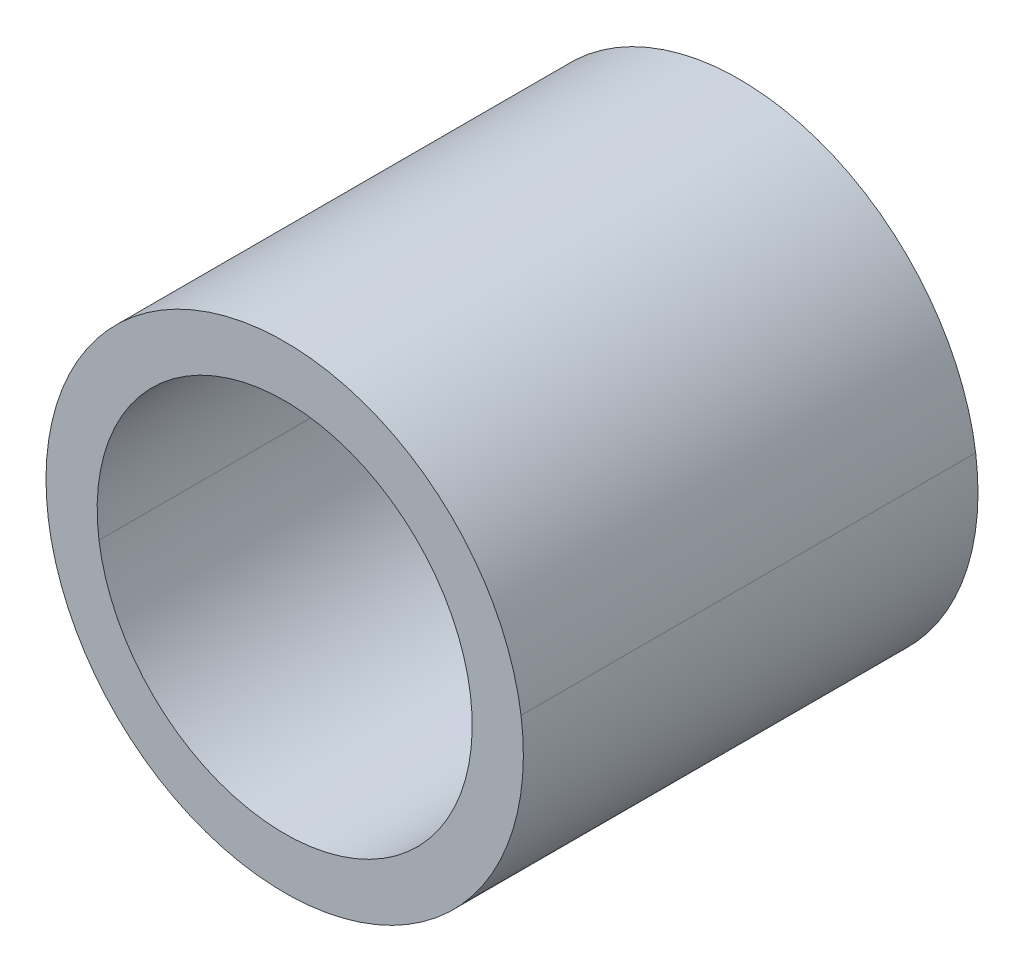
ISO-10303-21;
HEADER;
FILE_DESCRIPTION(('STEP AP214'),'2;1');
FILE_NAME('part.step','',(''),(''),'','','');
FILE_SCHEMA(('AUTOMOTIVE_DESIGN { 1 0 10303 214 1 1 1 1 }'));
ENDSEC;
DATA;
#1=APPLICATION_CONTEXT('core data for automotive mechanical design processes');
#2=APPLICATION_PROTOCOL_DEFINITION('international standard','automotive_design',2000,#1);
#3=PRODUCT_CONTEXT('',#1,'mechanical');
#4=PRODUCT('Part','Part','',(#3));
#5=PRODUCT_RELATED_PRODUCT_CATEGORY('part','',(#4));
#6=PRODUCT_DEFINITION_FORMATION('','',#4);
#7=PRODUCT_DEFINITION_CONTEXT('part definition',#1,'design');
#8=PRODUCT_DEFINITION('design','',#6,#7);
#9=PRODUCT_DEFINITION_SHAPE('','',#8);
#10=(LENGTH_UNIT() NAMED_UNIT(*) SI_UNIT(.MILLI.,.METRE.));
#11=(NAMED_UNIT(*) PLANE_ANGLE_UNIT() SI_UNIT($,.RADIAN.));
#12=(NAMED_UNIT(*) SI_UNIT($,.STERADIAN.) SOLID_ANGLE_UNIT());
#13=UNCERTAINTY_MEASURE_WITH_UNIT(LENGTH_MEASURE(1.E-05),#10,'distance_accuracy_value','');
#14=(GEOMETRIC_REPRESENTATION_CONTEXT(3) GLOBAL_UNCERTAINTY_ASSIGNED_CONTEXT((#13)) GLOBAL_UNIT_ASSIGNED_CONTEXT((#10,
#11,#12)) REPRESENTATION_CONTEXT('',''));
#15=CARTESIAN_POINT('',(0.,0.,0.));
#16=DIRECTION('',(0.,0.,1.));
#17=DIRECTION('',(1.,0.,0.));
#18=AXIS2_PLACEMENT_3D('',#15,#16,#17);
#19=CARTESIAN_POINT('',(3.70062969733469,6.31350070856451,-18.3));
#20=DIRECTION('',(0.,0.,-1.));
#21=DIRECTION('',(0.990268068741566,0.139173100960096,0.));
#22=AXIS2_PLACEMENT_3D('',#19,#20,#21);
#23=CYLINDRICAL_SURFACE('',#22,0.825);
#24=DIRECTION('',(0.,0.,-1.));
#25=VECTOR('',#24,1.);
#26=CARTESIAN_POINT('',(4.51760085404648,6.42831851685659,-15.8));
#27=LINE('',#26,#25);
#28=CARTESIAN_POINT('',(4.51760085404648,6.42831851685659,-15.8));
#29=VERTEX_POINT('',#28);
#30=CARTESIAN_POINT('',(4.51760085404648,6.42831851685659,-17.8));
#31=VERTEX_POINT('',#30);
#32=EDGE_CURVE('E11',#29,#31,#27,.T.);
#33=ORIENTED_EDGE('',*,*,#32,.T.);
#34=CARTESIAN_POINT('',(3.70062969733469,6.31350070856451,-17.8));
#35=DIRECTION('',(0.,0.,1.));
#36=DIRECTION('',(-0.990268068741566,-0.139173100960096,0.));
#37=AXIS2_PLACEMENT_3D('',#34,#35,#36);
#38=CIRCLE('',#37,0.825);
#39=CARTESIAN_POINT('',(2.8836585406229,6.19868290027243,-17.8));
#40=VERTEX_POINT('',#39);
#41=EDGE_CURVE('E103',#40,#31,#38,.T.);
#42=ORIENTED_EDGE('',*,*,#41,.F.);
#43=DIRECTION('',(0.,0.,-1.));
#44=VECTOR('',#43,1.);
#45=CARTESIAN_POINT('',(2.8836585406229,6.19868290027243,-15.8));
#46=LINE('',#45,#44);
#47=CARTESIAN_POINT('',(2.8836585406229,6.19868290027243,-15.8));
#48=VERTEX_POINT('',#47);
#49=EDGE_CURVE('E26',#48,#40,#46,.T.);
#50=ORIENTED_EDGE('',*,*,#49,.F.);
#51=CARTESIAN_POINT('',(3.70062969733469,6.31350070856451,-15.8));
#52=DIRECTION('',(0.,0.,-1.));
#53=DIRECTION('',(0.990268068741566,0.139173100960096,0.));
#54=AXIS2_PLACEMENT_3D('',#51,#52,#53);
#55=CIRCLE('',#54,0.825);
#56=EDGE_CURVE('E108',#29,#48,#55,.T.);
#57=ORIENTED_EDGE('',*,*,#56,.F.);
#58=EDGE_LOOP('',(#33,#42,#50,#57));
#59=FACE_BOUND('',#58,.T.);
#60=ADVANCED_FACE('F17',(#59),#23,.F.);
#61=CARTESIAN_POINT('',(3.70062969733469,6.31350070856451,-18.3));
#62=DIRECTION('',(0.,0.,-1.));
#63=DIRECTION('',(0.990268068741566,0.139173100960096,0.));
#64=AXIS2_PLACEMENT_3D('',#61,#62,#63);
#65=CYLINDRICAL_SURFACE('',#64,0.825);
#66=ORIENTED_EDGE('',*,*,#49,.T.);
#67=CARTESIAN_POINT('',(3.70062969733469,6.31350070856451,-17.8));
#68=DIRECTION('',(0.,0.,1.));
#69=DIRECTION('',(0.990268068741566,0.139173100960096,0.));
#70=AXIS2_PLACEMENT_3D('',#67,#68,#69);
#71=CIRCLE('',#70,0.825);
#72=EDGE_CURVE('E100',#31,#40,#71,.T.);
#73=ORIENTED_EDGE('',*,*,#72,.F.);
#74=ORIENTED_EDGE('',*,*,#32,.F.);
#75=CARTESIAN_POINT('',(3.70062969733469,6.31350070856451,-15.8));
#76=DIRECTION('',(0.,0.,-1.));
#77=DIRECTION('',(-0.990268068741566,-0.139173100960096,0.));
#78=AXIS2_PLACEMENT_3D('',#75,#76,#77);
#79=CIRCLE('',#78,0.825);
#80=EDGE_CURVE('E75',#48,#29,#79,.T.);
#81=ORIENTED_EDGE('',*,*,#80,.F.);
#82=EDGE_LOOP('',(#66,#73,#74,#81));
#83=FACE_BOUND('',#82,.T.);
#84=ADVANCED_FACE('F120',(#83),#65,.F.);
#85=CARTESIAN_POINT('',(3.70062969733469,6.31350070856451,-17.8));
#86=DIRECTION('',(0.,0.,1.));
#87=DIRECTION('',(1.,0.,0.));
#88=AXIS2_PLACEMENT_3D('',#85,#86,#87);
#89=PLANE('',#88);
#90=ORIENTED_EDGE('',*,*,#41,.T.);
#91=ORIENTED_EDGE('',*,*,#72,.T.);
#92=EDGE_LOOP('',(#90,#91));
#93=FACE_BOUND('',#92,.T.);
#94=CARTESIAN_POINT('',(3.70062969733469,6.31350070856451,-17.8));
#95=DIRECTION('',(0.,0.,-1.));
#96=DIRECTION('',(-0.990268068741566,-0.139173100960095,0.));
#97=AXIS2_PLACEMENT_3D('',#94,#95,#96);
#98=CIRCLE('',#97,1.05);
#99=CARTESIAN_POINT('',(2.66084822515604,6.16736895255641,-17.8));
#100=VERTEX_POINT('',#99);
#101=CARTESIAN_POINT('',(4.74041116951333,6.45963246457261,-17.8));
#102=VERTEX_POINT('',#101);
#103=EDGE_CURVE('E89',#100,#102,#98,.T.);
#104=ORIENTED_EDGE('',*,*,#103,.T.);
#105=CARTESIAN_POINT('',(3.70062969733469,6.31350070856451,-17.8));
#106=DIRECTION('',(0.,0.,-1.));
#107=DIRECTION('',(0.990268068741566,0.139173100960095,0.));
#108=AXIS2_PLACEMENT_3D('',#105,#106,#107);
#109=CIRCLE('',#108,1.05);
#110=EDGE_CURVE('E86',#102,#100,#109,.T.);
#111=ORIENTED_EDGE('',*,*,#110,.T.);
#112=EDGE_LOOP('',(#104,#111));
#113=FACE_BOUND('',#112,.T.);
#114=ADVANCED_FACE('F118',(#93,#113),#89,.F.);
#115=CARTESIAN_POINT('',(3.70062969733469,6.31350070856451,-18.3));
#116=DIRECTION('',(0.,0.,-1.));
#117=DIRECTION('',(0.990268068741566,0.139173100960095,0.));
#118=AXIS2_PLACEMENT_3D('',#115,#116,#117);
#119=CYLINDRICAL_SURFACE('',#118,1.05);
#120=DIRECTION('',(0.,0.,-1.));
#121=VECTOR('',#120,1.);
#122=CARTESIAN_POINT('',(2.66084822515604,6.16736895255641,-15.8));
#123=LINE('',#122,#121);
#124=CARTESIAN_POINT('',(2.66084822515604,6.16736895255641,-15.8));
#125=VERTEX_POINT('',#124);
#126=EDGE_CURVE('E82',#125,#100,#123,.T.);
#127=ORIENTED_EDGE('',*,*,#126,.T.);
#128=ORIENTED_EDGE('',*,*,#110,.F.);
#129=DIRECTION('',(0.,0.,-1.));
#130=VECTOR('',#129,1.);
#131=CARTESIAN_POINT('',(4.74041116951333,6.45963246457261,-15.8));
#132=LINE('',#131,#130);
#133=CARTESIAN_POINT('',(4.74041116951333,6.45963246457261,-15.8));
#134=VERTEX_POINT('',#133);
#135=EDGE_CURVE('E81',#134,#102,#132,.T.);
#136=ORIENTED_EDGE('',*,*,#135,.F.);
#137=CARTESIAN_POINT('',(3.70062969733469,6.31350070856451,-15.8));
#138=DIRECTION('',(0.,0.,1.));
#139=DIRECTION('',(-0.990268068741566,-0.139173100960095,0.));
#140=AXIS2_PLACEMENT_3D('',#137,#138,#139);
#141=CIRCLE('',#140,1.05);
#142=EDGE_CURVE('E59',#125,#134,#141,.T.);
#143=ORIENTED_EDGE('',*,*,#142,.F.);
#144=EDGE_LOOP('',(#127,#128,#136,#143));
#145=FACE_BOUND('',#144,.T.);
#146=ADVANCED_FACE('F85',(#145),#119,.T.);
#147=CARTESIAN_POINT('',(3.70062969733469,6.31350070856451,-15.8));
#148=DIRECTION('',(0.,0.,1.));
#149=DIRECTION('',(1.,0.,0.));
#150=AXIS2_PLACEMENT_3D('',#147,#148,#149);
#151=PLANE('',#150);
#152=ORIENTED_EDGE('',*,*,#80,.T.);
#153=ORIENTED_EDGE('',*,*,#56,.T.);
#154=EDGE_LOOP('',(#152,#153));
#155=FACE_BOUND('',#154,.T.);
#156=ORIENTED_EDGE('',*,*,#142,.T.);
#157=CARTESIAN_POINT('',(3.70062969733469,6.31350070856451,-15.8));
#158=DIRECTION('',(0.,0.,1.));
#159=DIRECTION('',(0.990268068741566,0.139173100960095,0.));
#160=AXIS2_PLACEMENT_3D('',#157,#158,#159);
#161=CIRCLE('',#160,1.05);
#162=EDGE_CURVE('E72',#134,#125,#161,.T.);
#163=ORIENTED_EDGE('',*,*,#162,.T.);
#164=EDGE_LOOP('',(#156,#163));
#165=FACE_BOUND('',#164,.T.);
#166=ADVANCED_FACE('F71',(#155,#165),#151,.T.);
#167=CARTESIAN_POINT('',(3.70062969733469,6.31350070856451,-18.3));
#168=DIRECTION('',(0.,0.,-1.));
#169=DIRECTION('',(0.990268068741566,0.139173100960095,0.));
#170=AXIS2_PLACEMENT_3D('',#167,#168,#169);
#171=CYLINDRICAL_SURFACE('',#170,1.05);
#172=ORIENTED_EDGE('',*,*,#135,.T.);
#173=ORIENTED_EDGE('',*,*,#103,.F.);
#174=ORIENTED_EDGE('',*,*,#126,.F.);
#175=ORIENTED_EDGE('',*,*,#162,.F.);
#176=EDGE_LOOP('',(#172,#173,#174,#175));
#177=FACE_BOUND('',#176,.T.);
#178=ADVANCED_FACE('F79',(#177),#171,.T.);
#179=CLOSED_SHELL('',(#60,#84,#114,#146,#166,#178));
#180=MANIFOLD_SOLID_BREP('B1',#179);
#181=ADVANCED_BREP_SHAPE_REPRESENTATION('',(#18,#180),#14);
#182=SHAPE_DEFINITION_REPRESENTATION(#9,#181);
ENDSEC;
END-ISO-10303-21;
